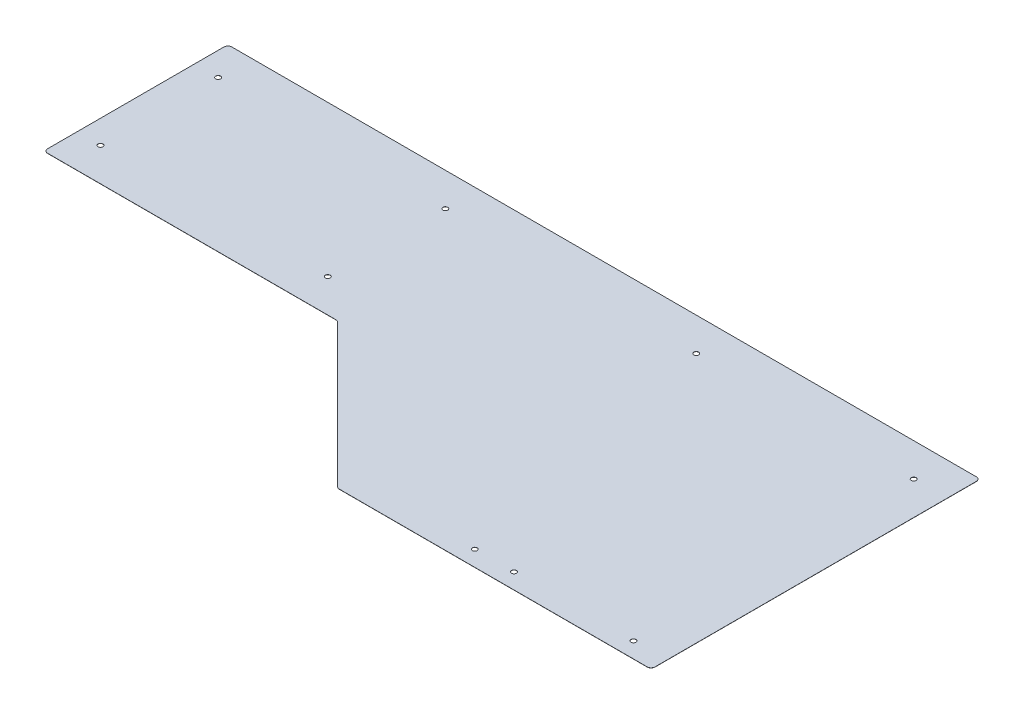
ISO-10303-21;
HEADER;
FILE_DESCRIPTION(('STEP AP214'),'2;1');
FILE_NAME('part.step','',(''),(''),'','','');
FILE_SCHEMA(('AUTOMOTIVE_DESIGN { 1 0 10303 214 1 1 1 1 }'));
ENDSEC;
DATA;
#1=APPLICATION_CONTEXT('core data for automotive mechanical design processes');
#2=APPLICATION_PROTOCOL_DEFINITION('international standard','automotive_design',2000,#1);
#3=PRODUCT_CONTEXT('',#1,'mechanical');
#4=PRODUCT('Part','Part','',(#3));
#5=PRODUCT_RELATED_PRODUCT_CATEGORY('part','',(#4));
#6=PRODUCT_DEFINITION_FORMATION('','',#4);
#7=PRODUCT_DEFINITION_CONTEXT('part definition',#1,'design');
#8=PRODUCT_DEFINITION('design','',#6,#7);
#9=PRODUCT_DEFINITION_SHAPE('','',#8);
#10=(LENGTH_UNIT() NAMED_UNIT(*) SI_UNIT(.MILLI.,.METRE.));
#11=(NAMED_UNIT(*) PLANE_ANGLE_UNIT() SI_UNIT($,.RADIAN.));
#12=(NAMED_UNIT(*) SI_UNIT($,.STERADIAN.) SOLID_ANGLE_UNIT());
#13=UNCERTAINTY_MEASURE_WITH_UNIT(LENGTH_MEASURE(1.E-05),#10,'distance_accuracy_value','');
#14=(GEOMETRIC_REPRESENTATION_CONTEXT(3) GLOBAL_UNCERTAINTY_ASSIGNED_CONTEXT((#13)) GLOBAL_UNIT_ASSIGNED_CONTEXT((#10,
#11,#12)) REPRESENTATION_CONTEXT('',''));
#15=CARTESIAN_POINT('',(0.,0.,0.));
#16=DIRECTION('',(0.,0.,1.));
#17=DIRECTION('',(1.,0.,0.));
#18=AXIS2_PLACEMENT_3D('',#15,#16,#17);
#19=CARTESIAN_POINT('',(-505.369743878931,1.5875,-6.35));
#20=DIRECTION('',(0.,-1.,0.));
#21=DIRECTION('',(0.,0.,-1.));
#22=AXIS2_PLACEMENT_3D('',#19,#20,#21);
#23=CYLINDRICAL_SURFACE('',#22,6.35000000000002);
#24=DIRECTION('',(0.,-1.,0.));
#25=VECTOR('',#24,1.);
#26=CARTESIAN_POINT('',(-505.369743878931,1.5875,0.));
#27=LINE('',#26,#25);
#28=CARTESIAN_POINT('',(-505.369743878931,0.254,0.));
#29=VERTEX_POINT('',#28);
#30=CARTESIAN_POINT('',(-505.369743878931,0.,0.));
#31=VERTEX_POINT('',#30);
#32=EDGE_CURVE('E272',#29,#31,#27,.T.);
#33=ORIENTED_EDGE('',*,*,#32,.F.);
#34=CARTESIAN_POINT('',(-505.369743878931,0.254,-6.35));
#35=DIRECTION('',(0.,-1.,0.));
#36=DIRECTION('',(0.,0.,-1.));
#37=AXIS2_PLACEMENT_3D('',#34,#35,#36);
#38=CIRCLE('',#37,6.35000000000002);
#39=CARTESIAN_POINT('',(-509.859871939465,0.254,-1.85987193946541));
#40=VERTEX_POINT('',#39);
#41=EDGE_CURVE('E189',#29,#40,#38,.T.);
#42=ORIENTED_EDGE('',*,*,#41,.T.);
#43=DIRECTION('',(0.,-1.,0.));
#44=VECTOR('',#43,1.);
#45=CARTESIAN_POINT('',(-509.859871939465,1.5875,-1.8598719394654));
#46=LINE('',#45,#44);
#47=CARTESIAN_POINT('',(-509.859871939465,0.,-1.8598719394654));
#48=VERTEX_POINT('',#47);
#49=EDGE_CURVE('E266',#40,#48,#46,.T.);
#50=ORIENTED_EDGE('',*,*,#49,.T.);
#51=CARTESIAN_POINT('',(-505.369743878931,0.,-6.35));
#52=DIRECTION('',(0.,1.,0.));
#53=DIRECTION('',(0.,0.,-1.));
#54=AXIS2_PLACEMENT_3D('',#51,#52,#53);
#55=CIRCLE('',#54,6.35000000000002);
#56=EDGE_CURVE('E246',#48,#31,#55,.T.);
#57=ORIENTED_EDGE('',*,*,#56,.T.);
#58=EDGE_LOOP('',(#33,#42,#50,#57));
#59=FACE_BOUND('',#58,.T.);
#60=ADVANCED_FACE('F35',(#59),#23,.T.);
#61=CARTESIAN_POINT('',(-505.369743878931,1.5875,0.));
#62=DIRECTION('',(0.,0.,-1.));
#63=DIRECTION('',(-1.,0.,0.));
#64=AXIS2_PLACEMENT_3D('',#61,#62,#63);
#65=PLANE('',#64);
#66=DIRECTION('',(0.,-1.,0.));
#67=VECTOR('',#66,1.);
#68=CARTESIAN_POINT('',(-6.35000000000002,1.5875,0.));
#69=LINE('',#68,#67);
#70=CARTESIAN_POINT('',(-6.35000000000002,0.,0.));
#71=VERTEX_POINT('',#70);
#72=CARTESIAN_POINT('',(-6.35,0.254,0.));
#73=VERTEX_POINT('',#72);
#74=EDGE_CURVE('E43',#71,#73,#69,.F.);
#75=ORIENTED_EDGE('',*,*,#74,.T.);
#76=DIRECTION('',(1.,0.,0.));
#77=VECTOR('',#76,1.);
#78=CARTESIAN_POINT('',(-1219.2,0.254,0.));
#79=LINE('',#78,#77);
#80=EDGE_CURVE('E132',#29,#73,#79,.T.);
#81=ORIENTED_EDGE('',*,*,#80,.F.);
#82=ORIENTED_EDGE('',*,*,#32,.T.);
#83=DIRECTION('',(1.,0.,0.));
#84=VECTOR('',#83,1.);
#85=CARTESIAN_POINT('',(-505.369743878931,0.,0.));
#86=LINE('',#85,#84);
#87=EDGE_CURVE('E170',#31,#71,#86,.T.);
#88=ORIENTED_EDGE('',*,*,#87,.T.);
#89=EDGE_LOOP('',(#75,#81,#82,#88));
#90=FACE_BOUND('',#89,.T.);
#91=ADVANCED_FACE('F168',(#90),#65,.F.);
#92=CARTESIAN_POINT('',(0.,1.5875,0.));
#93=DIRECTION('',(-1.,0.,0.));
#94=DIRECTION('',(0.,0.,1.));
#95=AXIS2_PLACEMENT_3D('',#92,#93,#94);
#96=PLANE('',#95);
#97=DIRECTION('',(0.,-1.,0.));
#98=VECTOR('',#97,1.);
#99=CARTESIAN_POINT('',(0.,1.5875,-527.05));
#100=LINE('',#99,#98);
#101=CARTESIAN_POINT('',(0.,0.,-527.05));
#102=VERTEX_POINT('',#101);
#103=CARTESIAN_POINT('',(0.,0.254,-527.05));
#104=VERTEX_POINT('',#103);
#105=EDGE_CURVE('E162',#102,#104,#100,.F.);
#106=ORIENTED_EDGE('',*,*,#105,.T.);
#107=DIRECTION('',(0.,0.,-1.));
#108=VECTOR('',#107,1.);
#109=CARTESIAN_POINT('',(0.,0.254,0.));
#110=LINE('',#109,#108);
#111=CARTESIAN_POINT('',(0.,0.254,-6.35));
#112=VERTEX_POINT('',#111);
#113=EDGE_CURVE('E133',#112,#104,#110,.T.);
#114=ORIENTED_EDGE('',*,*,#113,.F.);
#115=DIRECTION('',(0.,-1.,0.));
#116=VECTOR('',#115,1.);
#117=CARTESIAN_POINT('',(0.,1.5875,-6.35));
#118=LINE('',#117,#116);
#119=CARTESIAN_POINT('',(0.,0.,-6.35));
#120=VERTEX_POINT('',#119);
#121=EDGE_CURVE('E160',#112,#120,#118,.T.);
#122=ORIENTED_EDGE('',*,*,#121,.T.);
#123=DIRECTION('',(0.,0.,-1.));
#124=VECTOR('',#123,1.);
#125=CARTESIAN_POINT('',(0.,0.,0.));
#126=LINE('',#125,#124);
#127=EDGE_CURVE('E250',#120,#102,#126,.T.);
#128=ORIENTED_EDGE('',*,*,#127,.T.);
#129=EDGE_LOOP('',(#106,#114,#122,#128));
#130=FACE_BOUND('',#129,.T.);
#131=ADVANCED_FACE('F299',(#130),#96,.F.);
#132=CARTESIAN_POINT('',(-1219.2,1.5875,-533.4));
#133=DIRECTION('',(0.,0.,1.));
#134=DIRECTION('',(1.,0.,0.));
#135=AXIS2_PLACEMENT_3D('',#132,#133,#134);
#136=PLANE('',#135);
#137=DIRECTION('',(0.,-1.,0.));
#138=VECTOR('',#137,1.);
#139=CARTESIAN_POINT('',(-1212.85,1.5875,-533.4));
#140=LINE('',#139,#138);
#141=CARTESIAN_POINT('',(-1212.85,0.,-533.4));
#142=VERTEX_POINT('',#141);
#143=CARTESIAN_POINT('',(-1212.85,0.254,-533.4));
#144=VERTEX_POINT('',#143);
#145=EDGE_CURVE('E149',#142,#144,#140,.F.);
#146=ORIENTED_EDGE('',*,*,#145,.T.);
#147=DIRECTION('',(1.,0.,0.));
#148=VECTOR('',#147,1.);
#149=CARTESIAN_POINT('',(-1219.2,0.254,-533.4));
#150=LINE('',#149,#148);
#151=CARTESIAN_POINT('',(-6.35000000000008,0.254,-533.4));
#152=VERTEX_POINT('',#151);
#153=EDGE_CURVE('E49',#144,#152,#150,.T.);
#154=ORIENTED_EDGE('',*,*,#153,.T.);
#155=DIRECTION('',(0.,-1.,0.));
#156=VECTOR('',#155,1.);
#157=CARTESIAN_POINT('',(-6.35000000000008,1.5875,-533.4));
#158=LINE('',#157,#156);
#159=CARTESIAN_POINT('',(-6.35000000000052,0.,-533.4));
#160=VERTEX_POINT('',#159);
#161=EDGE_CURVE('E153',#152,#160,#158,.T.);
#162=ORIENTED_EDGE('',*,*,#161,.T.);
#163=DIRECTION('',(-1.,0.,0.));
#164=VECTOR('',#163,1.);
#165=CARTESIAN_POINT('',(-1219.2,0.,-533.4));
#166=LINE('',#165,#164);
#167=EDGE_CURVE('E253',#160,#142,#166,.T.);
#168=ORIENTED_EDGE('',*,*,#167,.T.);
#169=EDGE_LOOP('',(#146,#154,#162,#168));
#170=FACE_BOUND('',#169,.T.);
#171=ADVANCED_FACE('F322',(#170),#136,.F.);
#172=CARTESIAN_POINT('',(-1219.2,1.5875,-234.95));
#173=DIRECTION('',(1.,0.,0.));
#174=DIRECTION('',(0.,0.,-1.));
#175=AXIS2_PLACEMENT_3D('',#172,#173,#174);
#176=PLANE('',#175);
#177=DIRECTION('',(0.,-1.,0.));
#178=VECTOR('',#177,1.);
#179=CARTESIAN_POINT('',(-1219.2,1.5875,-241.3));
#180=LINE('',#179,#178);
#181=CARTESIAN_POINT('',(-1219.2,0.,-241.3));
#182=VERTEX_POINT('',#181);
#183=CARTESIAN_POINT('',(-1219.2,0.254,-241.3));
#184=VERTEX_POINT('',#183);
#185=EDGE_CURVE('E140',#182,#184,#180,.F.);
#186=ORIENTED_EDGE('',*,*,#185,.T.);
#187=DIRECTION('',(0.,0.,-1.));
#188=VECTOR('',#187,1.);
#189=CARTESIAN_POINT('',(-1219.2,0.254,0.));
#190=LINE('',#189,#188);
#191=CARTESIAN_POINT('',(-1219.2,0.254,-527.05));
#192=VERTEX_POINT('',#191);
#193=EDGE_CURVE('E123',#184,#192,#190,.T.);
#194=ORIENTED_EDGE('',*,*,#193,.T.);
#195=DIRECTION('',(0.,-1.,0.));
#196=VECTOR('',#195,1.);
#197=CARTESIAN_POINT('',(-1219.2,1.5875,-527.05));
#198=LINE('',#197,#196);
#199=CARTESIAN_POINT('',(-1219.2,0.,-527.05));
#200=VERTEX_POINT('',#199);
#201=EDGE_CURVE('E150',#192,#200,#198,.T.);
#202=ORIENTED_EDGE('',*,*,#201,.T.);
#203=DIRECTION('',(0.,0.,1.));
#204=VECTOR('',#203,1.);
#205=CARTESIAN_POINT('',(-1219.2,0.,-234.95));
#206=LINE('',#205,#204);
#207=EDGE_CURVE('E148',#200,#182,#206,.T.);
#208=ORIENTED_EDGE('',*,*,#207,.T.);
#209=EDGE_LOOP('',(#186,#194,#202,#208));
#210=FACE_BOUND('',#209,.T.);
#211=ADVANCED_FACE('F146',(#210),#176,.F.);
#212=CARTESIAN_POINT('',(-1219.2,1.5875,-234.95));
#213=DIRECTION('',(0.,0.,-1.));
#214=DIRECTION('',(-1.,0.,0.));
#215=AXIS2_PLACEMENT_3D('',#212,#213,#214);
#216=PLANE('',#215);
#217=DIRECTION('',(0.,-1.,0.));
#218=VECTOR('',#217,1.);
#219=CARTESIAN_POINT('',(-745.580256121068,1.5875,-234.95));
#220=LINE('',#219,#218);
#221=CARTESIAN_POINT('',(-745.580256121068,0.254,-234.95));
#222=VERTEX_POINT('',#221);
#223=CARTESIAN_POINT('',(-745.580256121068,0.,-234.95));
#224=VERTEX_POINT('',#223);
#225=EDGE_CURVE('E270',#222,#224,#220,.T.);
#226=ORIENTED_EDGE('',*,*,#225,.F.);
#227=DIRECTION('',(-1.,0.,0.));
#228=VECTOR('',#227,1.);
#229=CARTESIAN_POINT('',(-1219.2,0.254,-234.95));
#230=LINE('',#229,#228);
#231=CARTESIAN_POINT('',(-1212.85,0.254,-234.95));
#232=VERTEX_POINT('',#231);
#233=EDGE_CURVE('E142',#222,#232,#230,.T.);
#234=ORIENTED_EDGE('',*,*,#233,.T.);
#235=DIRECTION('',(0.,-1.,0.));
#236=VECTOR('',#235,1.);
#237=CARTESIAN_POINT('',(-1212.85,1.5875,-234.95));
#238=LINE('',#237,#236);
#239=CARTESIAN_POINT('',(-1212.85,0.,-234.95));
#240=VERTEX_POINT('',#239);
#241=EDGE_CURVE('E141',#232,#240,#238,.T.);
#242=ORIENTED_EDGE('',*,*,#241,.T.);
#243=DIRECTION('',(1.,0.,0.));
#244=VECTOR('',#243,1.);
#245=CARTESIAN_POINT('',(-1219.2,0.,-234.95));
#246=LINE('',#245,#244);
#247=EDGE_CURVE('E257',#240,#224,#246,.T.);
#248=ORIENTED_EDGE('',*,*,#247,.T.);
#249=EDGE_LOOP('',(#226,#234,#242,#248));
#250=FACE_BOUND('',#249,.T.);
#251=ADVANCED_FACE('F285',(#250),#216,.F.);
#252=CARTESIAN_POINT('',(-745.580256121068,1.5875,-228.6));
#253=DIRECTION('',(0.,-1.,0.));
#254=DIRECTION('',(0.,0.,-1.));
#255=AXIS2_PLACEMENT_3D('',#252,#253,#254);
#256=CYLINDRICAL_SURFACE('',#255,6.35);
#257=DIRECTION('',(0.,-1.,0.));
#258=VECTOR('',#257,1.);
#259=CARTESIAN_POINT('',(-741.090128060534,1.5875,-233.090128060535));
#260=LINE('',#259,#258);
#261=CARTESIAN_POINT('',(-741.090128060534,0.254,-233.090128060535));
#262=VERTEX_POINT('',#261);
#263=CARTESIAN_POINT('',(-741.090128060534,0.,-233.090128060535));
#264=VERTEX_POINT('',#263);
#265=EDGE_CURVE('E268',#262,#264,#260,.T.);
#266=ORIENTED_EDGE('',*,*,#265,.F.);
#267=CARTESIAN_POINT('',(-745.580256121068,0.254,-228.6));
#268=DIRECTION('',(0.,-1.,0.));
#269=DIRECTION('',(0.,0.,-1.));
#270=AXIS2_PLACEMENT_3D('',#267,#268,#269);
#271=CIRCLE('',#270,6.35);
#272=EDGE_CURVE('E183',#262,#222,#271,.F.);
#273=ORIENTED_EDGE('',*,*,#272,.T.);
#274=ORIENTED_EDGE('',*,*,#225,.T.);
#275=CARTESIAN_POINT('',(-745.580256121068,0.,-228.6));
#276=DIRECTION('',(0.,-1.,0.));
#277=DIRECTION('',(0.,0.,1.));
#278=AXIS2_PLACEMENT_3D('',#275,#276,#277);
#279=CIRCLE('',#278,6.35);
#280=EDGE_CURVE('E260',#224,#264,#279,.T.);
#281=ORIENTED_EDGE('',*,*,#280,.T.);
#282=EDGE_LOOP('',(#266,#273,#274,#281));
#283=FACE_BOUND('',#282,.T.);
#284=ADVANCED_FACE('F288',(#283),#256,.F.);
#285=CARTESIAN_POINT('',(-741.090128060534,1.5875,-233.090128060535));
#286=DIRECTION('',(0.707106781186549,0.,-0.707106781186546));
#287=DIRECTION('',(-0.707106781186546,0.,-0.707106781186549));
#288=AXIS2_PLACEMENT_3D('',#285,#286,#287);
#289=PLANE('',#288);
#290=ORIENTED_EDGE('',*,*,#49,.F.);
#291=DIRECTION('',(-0.707106781186546,0.,-0.707106781186549));
#292=VECTOR('',#291,1.);
#293=CARTESIAN_POINT('',(-741.090128060534,0.254,-233.090128060535));
#294=LINE('',#293,#292);
#295=EDGE_CURVE('E186',#40,#262,#294,.T.);
#296=ORIENTED_EDGE('',*,*,#295,.T.);
#297=ORIENTED_EDGE('',*,*,#265,.T.);
#298=DIRECTION('',(0.707106781186546,0.,0.707106781186549));
#299=VECTOR('',#298,1.);
#300=CARTESIAN_POINT('',(-741.090128060534,0.,-233.090128060535));
#301=LINE('',#300,#299);
#302=EDGE_CURVE('E263',#264,#48,#301,.T.);
#303=ORIENTED_EDGE('',*,*,#302,.T.);
#304=EDGE_LOOP('',(#290,#296,#297,#303));
#305=FACE_BOUND('',#304,.T.);
#306=ADVANCED_FACE('F291',(#305),#289,.F.);
#307=CARTESIAN_POINT('',(-505.369743878931,0.,-6.35));
#308=DIRECTION('',(0.,-1.,0.));
#309=DIRECTION('',(0.,0.,-1.));
#310=AXIS2_PLACEMENT_3D('',#307,#308,#309);
#311=PLANE('',#310);
#312=CARTESIAN_POINT('',(-1181.1,0.,-479.425));
#313=DIRECTION('',(0.,1.,0.));
#314=DIRECTION('',(0.,0.,1.));
#315=AXIS2_PLACEMENT_3D('',#312,#313,#314);
#316=CIRCLE('',#315,3.96875000000008);
#317=CARTESIAN_POINT('',(-1181.1,0.,-475.45625));
#318=VERTEX_POINT('',#317);
#319=EDGE_CURVE('E219',#318,#318,#316,.T.);
#320=ORIENTED_EDGE('',*,*,#319,.T.);
#321=EDGE_LOOP('',(#320));
#322=FACE_BOUND('',#321,.T.);
#323=CARTESIAN_POINT('',(-1181.1,0.,-288.925));
#324=DIRECTION('',(0.,1.,0.));
#325=DIRECTION('',(0.,0.,1.));
#326=AXIS2_PLACEMENT_3D('',#323,#324,#325);
#327=CIRCLE('',#326,3.96875000000008);
#328=CARTESIAN_POINT('',(-1181.1,0.,-284.95625));
#329=VERTEX_POINT('',#328);
#330=EDGE_CURVE('E222',#329,#329,#327,.T.);
#331=ORIENTED_EDGE('',*,*,#330,.T.);
#332=EDGE_LOOP('',(#331));
#333=FACE_BOUND('',#332,.T.);
#334=CARTESIAN_POINT('',(-812.8,0.,-288.925));
#335=DIRECTION('',(0.,1.,0.));
#336=DIRECTION('',(0.,0.,1.));
#337=AXIS2_PLACEMENT_3D('',#334,#335,#336);
#338=CIRCLE('',#337,3.96874999999997);
#339=CARTESIAN_POINT('',(-812.8,0.,-284.95625));
#340=VERTEX_POINT('',#339);
#341=EDGE_CURVE('E225',#340,#340,#338,.T.);
#342=ORIENTED_EDGE('',*,*,#341,.T.);
#343=EDGE_LOOP('',(#342));
#344=FACE_BOUND('',#343,.T.);
#345=CARTESIAN_POINT('',(-812.8,0.,-479.425));
#346=DIRECTION('',(0.,1.,0.));
#347=DIRECTION('',(0.,0.,1.));
#348=AXIS2_PLACEMENT_3D('',#345,#346,#347);
#349=CIRCLE('',#348,3.96874999999997);
#350=CARTESIAN_POINT('',(-812.8,0.,-475.45625));
#351=VERTEX_POINT('',#350);
#352=EDGE_CURVE('E228',#351,#351,#349,.T.);
#353=ORIENTED_EDGE('',*,*,#352,.T.);
#354=EDGE_LOOP('',(#353));
#355=FACE_BOUND('',#354,.T.);
#356=CARTESIAN_POINT('',(-406.4,0.,-479.425));
#357=DIRECTION('',(0.,1.,0.));
#358=DIRECTION('',(0.,0.,1.));
#359=AXIS2_PLACEMENT_3D('',#356,#357,#358);
#360=CIRCLE('',#359,3.96875000000002);
#361=CARTESIAN_POINT('',(-406.4,0.,-475.45625));
#362=VERTEX_POINT('',#361);
#363=EDGE_CURVE('E231',#362,#362,#360,.T.);
#364=ORIENTED_EDGE('',*,*,#363,.T.);
#365=EDGE_LOOP('',(#364));
#366=FACE_BOUND('',#365,.T.);
#367=CARTESIAN_POINT('',(-53.975,0.,-479.425));
#368=DIRECTION('',(0.,1.,0.));
#369=DIRECTION('',(0.,0.,1.));
#370=AXIS2_PLACEMENT_3D('',#367,#368,#369);
#371=CIRCLE('',#370,3.96875);
#372=CARTESIAN_POINT('',(-53.975,0.,-475.45625));
#373=VERTEX_POINT('',#372);
#374=EDGE_CURVE('E234',#373,#373,#371,.T.);
#375=ORIENTED_EDGE('',*,*,#374,.T.);
#376=EDGE_LOOP('',(#375));
#377=FACE_BOUND('',#376,.T.);
#378=CARTESIAN_POINT('',(-53.975,0.,-25.4));
#379=DIRECTION('',(0.,1.,0.));
#380=DIRECTION('',(0.,0.,1.));
#381=AXIS2_PLACEMENT_3D('',#378,#379,#380);
#382=CIRCLE('',#381,3.96875);
#383=CARTESIAN_POINT('',(-53.975,0.,-21.43125));
#384=VERTEX_POINT('',#383);
#385=EDGE_CURVE('E237',#384,#384,#382,.T.);
#386=ORIENTED_EDGE('',*,*,#385,.T.);
#387=EDGE_LOOP('',(#386));
#388=FACE_BOUND('',#387,.T.);
#389=CARTESIAN_POINT('',(-247.65,0.,-25.4));
#390=DIRECTION('',(0.,1.,0.));
#391=DIRECTION('',(0.,0.,1.));
#392=AXIS2_PLACEMENT_3D('',#389,#390,#391);
#393=CIRCLE('',#392,3.96874999999999);
#394=CARTESIAN_POINT('',(-247.65,0.,-21.43125));
#395=VERTEX_POINT('',#394);
#396=EDGE_CURVE('E240',#395,#395,#393,.T.);
#397=ORIENTED_EDGE('',*,*,#396,.T.);
#398=EDGE_LOOP('',(#397));
#399=FACE_BOUND('',#398,.T.);
#400=CARTESIAN_POINT('',(-311.15,0.,-25.4));
#401=DIRECTION('',(0.,1.,0.));
#402=DIRECTION('',(0.,0.,1.));
#403=AXIS2_PLACEMENT_3D('',#400,#401,#402);
#404=CIRCLE('',#403,3.96875000000002);
#405=CARTESIAN_POINT('',(-311.15,0.,-21.43125));
#406=VERTEX_POINT('',#405);
#407=EDGE_CURVE('E243',#406,#406,#404,.T.);
#408=ORIENTED_EDGE('',*,*,#407,.T.);
#409=EDGE_LOOP('',(#408));
#410=FACE_BOUND('',#409,.T.);
#411=ORIENTED_EDGE('',*,*,#247,.F.);
#412=CARTESIAN_POINT('',(-1212.85,0.,-241.3));
#413=DIRECTION('',(0.,-1.,0.));
#414=DIRECTION('',(0.,0.,-1.));
#415=AXIS2_PLACEMENT_3D('',#412,#413,#414);
#416=CIRCLE('',#415,6.35);
#417=EDGE_CURVE('E155',#240,#182,#416,.T.);
#418=ORIENTED_EDGE('',*,*,#417,.T.);
#419=ORIENTED_EDGE('',*,*,#207,.F.);
#420=CARTESIAN_POINT('',(-1212.85,0.,-527.05));
#421=DIRECTION('',(0.,-1.,0.));
#422=DIRECTION('',(0.,0.,-1.));
#423=AXIS2_PLACEMENT_3D('',#420,#421,#422);
#424=CIRCLE('',#423,6.35);
#425=EDGE_CURVE('E275',#200,#142,#424,.T.);
#426=ORIENTED_EDGE('',*,*,#425,.T.);
#427=ORIENTED_EDGE('',*,*,#167,.F.);
#428=CARTESIAN_POINT('',(-6.35000000000008,0.,-527.05));
#429=DIRECTION('',(0.,-1.,0.));
#430=DIRECTION('',(0.,0.,-1.));
#431=AXIS2_PLACEMENT_3D('',#428,#429,#430);
#432=CIRCLE('',#431,6.35);
#433=EDGE_CURVE('E278',#160,#102,#432,.T.);
#434=ORIENTED_EDGE('',*,*,#433,.T.);
#435=ORIENTED_EDGE('',*,*,#127,.F.);
#436=CARTESIAN_POINT('',(-6.35,0.,-6.35));
#437=DIRECTION('',(0.,-1.,0.));
#438=DIRECTION('',(0.,0.,-1.));
#439=AXIS2_PLACEMENT_3D('',#436,#437,#438);
#440=CIRCLE('',#439,6.35);
#441=EDGE_CURVE('E57',#120,#71,#440,.T.);
#442=ORIENTED_EDGE('',*,*,#441,.T.);
#443=ORIENTED_EDGE('',*,*,#87,.F.);
#444=ORIENTED_EDGE('',*,*,#56,.F.);
#445=ORIENTED_EDGE('',*,*,#302,.F.);
#446=ORIENTED_EDGE('',*,*,#280,.F.);
#447=EDGE_LOOP('',(#411,#418,#419,#426,#427,#434,#435,#442,#443,#444,#445,#446));
#448=FACE_BOUND('',#447,.T.);
#449=ADVANCED_FACE('F280',(#322,#333,#344,#355,#366,#377,#388,#399,#410,#448),#311,.T.);
#450=CARTESIAN_POINT('',(-311.15,1.5875,-25.4));
#451=DIRECTION('',(0.,1.,0.));
#452=DIRECTION('',(0.,0.,1.));
#453=AXIS2_PLACEMENT_3D('',#450,#451,#452);
#454=CYLINDRICAL_SURFACE('',#453,3.96875000000002);
#455=CARTESIAN_POINT('',(-311.15,0.254,-25.4));
#456=DIRECTION('',(0.,-1.,0.));
#457=DIRECTION('',(0.,0.,-1.));
#458=AXIS2_PLACEMENT_3D('',#455,#456,#457);
#459=CIRCLE('',#458,3.96875000000002);
#460=CARTESIAN_POINT('',(-311.15,0.254,-29.36875));
#461=VERTEX_POINT('',#460);
#462=EDGE_CURVE('E216',#461,#461,#459,.F.);
#463=ORIENTED_EDGE('',*,*,#462,.T.);
#464=EDGE_LOOP('',(#463));
#465=FACE_BOUND('',#464,.T.);
#466=ORIENTED_EDGE('',*,*,#407,.F.);
#467=EDGE_LOOP('',(#466));
#468=FACE_BOUND('',#467,.T.);
#469=ADVANCED_FACE('F346',(#465,#468),#454,.F.);
#470=CARTESIAN_POINT('',(-247.65,1.5875,-25.4));
#471=DIRECTION('',(0.,1.,0.));
#472=DIRECTION('',(0.,0.,1.));
#473=AXIS2_PLACEMENT_3D('',#470,#471,#472);
#474=CYLINDRICAL_SURFACE('',#473,3.96874999999999);
#475=CARTESIAN_POINT('',(-247.65,0.254,-25.4));
#476=DIRECTION('',(0.,-1.,0.));
#477=DIRECTION('',(0.,0.,-1.));
#478=AXIS2_PLACEMENT_3D('',#475,#476,#477);
#479=CIRCLE('',#478,3.96874999999999);
#480=CARTESIAN_POINT('',(-247.65,0.254,-29.36875));
#481=VERTEX_POINT('',#480);
#482=EDGE_CURVE('E213',#481,#481,#479,.F.);
#483=ORIENTED_EDGE('',*,*,#482,.T.);
#484=EDGE_LOOP('',(#483));
#485=FACE_BOUND('',#484,.T.);
#486=ORIENTED_EDGE('',*,*,#396,.F.);
#487=EDGE_LOOP('',(#486));
#488=FACE_BOUND('',#487,.T.);
#489=ADVANCED_FACE('F350',(#485,#488),#474,.F.);
#490=CARTESIAN_POINT('',(-53.975,1.5875,-25.4));
#491=DIRECTION('',(0.,1.,0.));
#492=DIRECTION('',(0.,0.,1.));
#493=AXIS2_PLACEMENT_3D('',#490,#491,#492);
#494=CYLINDRICAL_SURFACE('',#493,3.96875);
#495=CARTESIAN_POINT('',(-53.975,0.254,-25.4));
#496=DIRECTION('',(0.,-1.,0.));
#497=DIRECTION('',(0.,0.,-1.));
#498=AXIS2_PLACEMENT_3D('',#495,#496,#497);
#499=CIRCLE('',#498,3.96875);
#500=CARTESIAN_POINT('',(-53.975,0.254,-29.36875));
#501=VERTEX_POINT('',#500);
#502=EDGE_CURVE('E210',#501,#501,#499,.F.);
#503=ORIENTED_EDGE('',*,*,#502,.T.);
#504=EDGE_LOOP('',(#503));
#505=FACE_BOUND('',#504,.T.);
#506=ORIENTED_EDGE('',*,*,#385,.F.);
#507=EDGE_LOOP('',(#506));
#508=FACE_BOUND('',#507,.T.);
#509=ADVANCED_FACE('F354',(#505,#508),#494,.F.);
#510=CARTESIAN_POINT('',(-53.975,1.5875,-479.425));
#511=DIRECTION('',(0.,1.,0.));
#512=DIRECTION('',(0.,0.,1.));
#513=AXIS2_PLACEMENT_3D('',#510,#511,#512);
#514=CYLINDRICAL_SURFACE('',#513,3.96875);
#515=CARTESIAN_POINT('',(-53.975,0.254,-479.425));
#516=DIRECTION('',(0.,-1.,0.));
#517=DIRECTION('',(0.,0.,-1.));
#518=AXIS2_PLACEMENT_3D('',#515,#516,#517);
#519=CIRCLE('',#518,3.96875);
#520=CARTESIAN_POINT('',(-53.975,0.254,-483.39375));
#521=VERTEX_POINT('',#520);
#522=EDGE_CURVE('E207',#521,#521,#519,.F.);
#523=ORIENTED_EDGE('',*,*,#522,.T.);
#524=EDGE_LOOP('',(#523));
#525=FACE_BOUND('',#524,.T.);
#526=ORIENTED_EDGE('',*,*,#374,.F.);
#527=EDGE_LOOP('',(#526));
#528=FACE_BOUND('',#527,.T.);
#529=ADVANCED_FACE('F358',(#525,#528),#514,.F.);
#530=CARTESIAN_POINT('',(-406.4,1.5875,-479.425));
#531=DIRECTION('',(0.,1.,0.));
#532=DIRECTION('',(0.,0.,1.));
#533=AXIS2_PLACEMENT_3D('',#530,#531,#532);
#534=CYLINDRICAL_SURFACE('',#533,3.96875000000002);
#535=CARTESIAN_POINT('',(-406.4,0.254,-479.425));
#536=DIRECTION('',(0.,-1.,0.));
#537=DIRECTION('',(0.,0.,-1.));
#538=AXIS2_PLACEMENT_3D('',#535,#536,#537);
#539=CIRCLE('',#538,3.96875000000002);
#540=CARTESIAN_POINT('',(-406.4,0.254,-483.39375));
#541=VERTEX_POINT('',#540);
#542=EDGE_CURVE('E204',#541,#541,#539,.F.);
#543=ORIENTED_EDGE('',*,*,#542,.T.);
#544=EDGE_LOOP('',(#543));
#545=FACE_BOUND('',#544,.T.);
#546=ORIENTED_EDGE('',*,*,#363,.F.);
#547=EDGE_LOOP('',(#546));
#548=FACE_BOUND('',#547,.T.);
#549=ADVANCED_FACE('F362',(#545,#548),#534,.F.);
#550=CARTESIAN_POINT('',(-812.8,1.5875,-479.425));
#551=DIRECTION('',(0.,1.,0.));
#552=DIRECTION('',(0.,0.,1.));
#553=AXIS2_PLACEMENT_3D('',#550,#551,#552);
#554=CYLINDRICAL_SURFACE('',#553,3.96874999999997);
#555=CARTESIAN_POINT('',(-812.8,0.254,-479.425));
#556=DIRECTION('',(0.,-1.,0.));
#557=DIRECTION('',(0.,0.,-1.));
#558=AXIS2_PLACEMENT_3D('',#555,#556,#557);
#559=CIRCLE('',#558,3.96874999999997);
#560=CARTESIAN_POINT('',(-812.8,0.254,-483.39375));
#561=VERTEX_POINT('',#560);
#562=EDGE_CURVE('E201',#561,#561,#559,.F.);
#563=ORIENTED_EDGE('',*,*,#562,.T.);
#564=EDGE_LOOP('',(#563));
#565=FACE_BOUND('',#564,.T.);
#566=ORIENTED_EDGE('',*,*,#352,.F.);
#567=EDGE_LOOP('',(#566));
#568=FACE_BOUND('',#567,.T.);
#569=ADVANCED_FACE('F366',(#565,#568),#554,.F.);
#570=CARTESIAN_POINT('',(-812.8,1.5875,-288.925));
#571=DIRECTION('',(0.,1.,0.));
#572=DIRECTION('',(0.,0.,1.));
#573=AXIS2_PLACEMENT_3D('',#570,#571,#572);
#574=CYLINDRICAL_SURFACE('',#573,3.96874999999997);
#575=CARTESIAN_POINT('',(-812.8,0.254,-288.925));
#576=DIRECTION('',(0.,-1.,0.));
#577=DIRECTION('',(0.,0.,-1.));
#578=AXIS2_PLACEMENT_3D('',#575,#576,#577);
#579=CIRCLE('',#578,3.96874999999997);
#580=CARTESIAN_POINT('',(-812.8,0.254,-292.89375));
#581=VERTEX_POINT('',#580);
#582=EDGE_CURVE('E198',#581,#581,#579,.F.);
#583=ORIENTED_EDGE('',*,*,#582,.T.);
#584=EDGE_LOOP('',(#583));
#585=FACE_BOUND('',#584,.T.);
#586=ORIENTED_EDGE('',*,*,#341,.F.);
#587=EDGE_LOOP('',(#586));
#588=FACE_BOUND('',#587,.T.);
#589=ADVANCED_FACE('F370',(#585,#588),#574,.F.);
#590=CARTESIAN_POINT('',(-1181.1,1.5875,-288.925));
#591=DIRECTION('',(0.,1.,0.));
#592=DIRECTION('',(0.,0.,1.));
#593=AXIS2_PLACEMENT_3D('',#590,#591,#592);
#594=CYLINDRICAL_SURFACE('',#593,3.96875000000008);
#595=CARTESIAN_POINT('',(-1181.1,0.254,-288.925));
#596=DIRECTION('',(0.,-1.,0.));
#597=DIRECTION('',(0.,0.,-1.));
#598=AXIS2_PLACEMENT_3D('',#595,#596,#597);
#599=CIRCLE('',#598,3.96875000000008);
#600=CARTESIAN_POINT('',(-1181.1,0.254,-292.89375));
#601=VERTEX_POINT('',#600);
#602=EDGE_CURVE('E195',#601,#601,#599,.F.);
#603=ORIENTED_EDGE('',*,*,#602,.T.);
#604=EDGE_LOOP('',(#603));
#605=FACE_BOUND('',#604,.T.);
#606=ORIENTED_EDGE('',*,*,#330,.F.);
#607=EDGE_LOOP('',(#606));
#608=FACE_BOUND('',#607,.T.);
#609=ADVANCED_FACE('F374',(#605,#608),#594,.F.);
#610=CARTESIAN_POINT('',(-1181.1,1.5875,-479.425));
#611=DIRECTION('',(0.,1.,0.));
#612=DIRECTION('',(0.,0.,1.));
#613=AXIS2_PLACEMENT_3D('',#610,#611,#612);
#614=CYLINDRICAL_SURFACE('',#613,3.96875000000008);
#615=CARTESIAN_POINT('',(-1181.1,0.254,-479.425));
#616=DIRECTION('',(0.,-1.,0.));
#617=DIRECTION('',(0.,0.,-1.));
#618=AXIS2_PLACEMENT_3D('',#615,#616,#617);
#619=CIRCLE('',#618,3.96875000000008);
#620=CARTESIAN_POINT('',(-1181.1,0.254,-483.39375));
#621=VERTEX_POINT('',#620);
#622=EDGE_CURVE('E192',#621,#621,#619,.F.);
#623=ORIENTED_EDGE('',*,*,#622,.T.);
#624=EDGE_LOOP('',(#623));
#625=FACE_BOUND('',#624,.T.);
#626=ORIENTED_EDGE('',*,*,#319,.F.);
#627=EDGE_LOOP('',(#626));
#628=FACE_BOUND('',#627,.T.);
#629=ADVANCED_FACE('F306',(#625,#628),#614,.F.);
#630=CARTESIAN_POINT('',(-1212.85,1.5875,-241.3));
#631=DIRECTION('',(0.,-1.,0.));
#632=DIRECTION('',(0.,0.,-1.));
#633=AXIS2_PLACEMENT_3D('',#630,#631,#632);
#634=CYLINDRICAL_SURFACE('',#633,6.35);
#635=CARTESIAN_POINT('',(-1212.85,0.254,-241.3));
#636=DIRECTION('',(0.,-1.,0.));
#637=DIRECTION('',(0.,0.,-1.));
#638=AXIS2_PLACEMENT_3D('',#635,#636,#637);
#639=CIRCLE('',#638,6.35);
#640=EDGE_CURVE('E127',#184,#232,#639,.F.);
#641=ORIENTED_EDGE('',*,*,#640,.F.);
#642=ORIENTED_EDGE('',*,*,#185,.F.);
#643=ORIENTED_EDGE('',*,*,#417,.F.);
#644=ORIENTED_EDGE('',*,*,#241,.F.);
#645=EDGE_LOOP('',(#641,#642,#643,#644));
#646=FACE_BOUND('',#645,.T.);
#647=ADVANCED_FACE('F138',(#646),#634,.T.);
#648=CARTESIAN_POINT('',(-6.35000000000008,1.5875,-527.05));
#649=DIRECTION('',(0.,-1.,0.));
#650=DIRECTION('',(0.,0.,-1.));
#651=AXIS2_PLACEMENT_3D('',#648,#649,#650);
#652=CYLINDRICAL_SURFACE('',#651,6.35);
#653=CARTESIAN_POINT('',(-6.35000000000008,0.254,-527.05));
#654=DIRECTION('',(0.,-1.,0.));
#655=DIRECTION('',(0.,0.,-1.));
#656=AXIS2_PLACEMENT_3D('',#653,#654,#655);
#657=CIRCLE('',#656,6.35);
#658=EDGE_CURVE('E143',#104,#152,#657,.F.);
#659=ORIENTED_EDGE('',*,*,#658,.F.);
#660=ORIENTED_EDGE('',*,*,#105,.F.);
#661=ORIENTED_EDGE('',*,*,#433,.F.);
#662=ORIENTED_EDGE('',*,*,#161,.F.);
#663=EDGE_LOOP('',(#659,#660,#661,#662));
#664=FACE_BOUND('',#663,.T.);
#665=ADVANCED_FACE('F305',(#664),#652,.T.);
#666=CARTESIAN_POINT('',(-6.35,1.5875,-6.35));
#667=DIRECTION('',(0.,-1.,0.));
#668=DIRECTION('',(0.,0.,-1.));
#669=AXIS2_PLACEMENT_3D('',#666,#667,#668);
#670=CYLINDRICAL_SURFACE('',#669,6.35);
#671=CARTESIAN_POINT('',(-6.35,0.254,-6.35));
#672=DIRECTION('',(0.,-1.,0.));
#673=DIRECTION('',(0.,0.,-1.));
#674=AXIS2_PLACEMENT_3D('',#671,#672,#673);
#675=CIRCLE('',#674,6.35);
#676=EDGE_CURVE('E175',#73,#112,#675,.F.);
#677=ORIENTED_EDGE('',*,*,#676,.F.);
#678=ORIENTED_EDGE('',*,*,#74,.F.);
#679=ORIENTED_EDGE('',*,*,#441,.F.);
#680=ORIENTED_EDGE('',*,*,#121,.F.);
#681=EDGE_LOOP('',(#677,#678,#679,#680));
#682=FACE_BOUND('',#681,.T.);
#683=ADVANCED_FACE('F173',(#682),#670,.T.);
#684=CARTESIAN_POINT('',(-1212.85,1.5875,-527.05));
#685=DIRECTION('',(0.,-1.,0.));
#686=DIRECTION('',(0.,0.,-1.));
#687=AXIS2_PLACEMENT_3D('',#684,#685,#686);
#688=CYLINDRICAL_SURFACE('',#687,6.35);
#689=CARTESIAN_POINT('',(-1212.85,0.254,-527.05));
#690=DIRECTION('',(0.,-1.,0.));
#691=DIRECTION('',(0.,0.,-1.));
#692=AXIS2_PLACEMENT_3D('',#689,#690,#691);
#693=CIRCLE('',#692,6.35);
#694=EDGE_CURVE('E11',#144,#192,#693,.F.);
#695=ORIENTED_EDGE('',*,*,#694,.F.);
#696=ORIENTED_EDGE('',*,*,#145,.F.);
#697=ORIENTED_EDGE('',*,*,#425,.F.);
#698=ORIENTED_EDGE('',*,*,#201,.F.);
#699=EDGE_LOOP('',(#695,#696,#697,#698));
#700=FACE_BOUND('',#699,.T.);
#701=ADVANCED_FACE('F37',(#700),#688,.T.);
#702=CARTESIAN_POINT('',(-1219.2,0.254,0.));
#703=DIRECTION('',(0.,-1.,0.));
#704=DIRECTION('',(0.,0.,-1.));
#705=AXIS2_PLACEMENT_3D('',#702,#703,#704);
#706=PLANE('',#705);
#707=ORIENTED_EDGE('',*,*,#482,.F.);
#708=EDGE_LOOP('',(#707));
#709=FACE_BOUND('',#708,.T.);
#710=ORIENTED_EDGE('',*,*,#522,.F.);
#711=EDGE_LOOP('',(#710));
#712=FACE_BOUND('',#711,.T.);
#713=ORIENTED_EDGE('',*,*,#562,.F.);
#714=EDGE_LOOP('',(#713));
#715=FACE_BOUND('',#714,.T.);
#716=ORIENTED_EDGE('',*,*,#602,.F.);
#717=EDGE_LOOP('',(#716));
#718=FACE_BOUND('',#717,.T.);
#719=ORIENTED_EDGE('',*,*,#80,.T.);
#720=ORIENTED_EDGE('',*,*,#676,.T.);
#721=ORIENTED_EDGE('',*,*,#113,.T.);
#722=ORIENTED_EDGE('',*,*,#658,.T.);
#723=ORIENTED_EDGE('',*,*,#153,.F.);
#724=ORIENTED_EDGE('',*,*,#694,.T.);
#725=ORIENTED_EDGE('',*,*,#193,.F.);
#726=ORIENTED_EDGE('',*,*,#640,.T.);
#727=ORIENTED_EDGE('',*,*,#233,.F.);
#728=ORIENTED_EDGE('',*,*,#272,.F.);
#729=ORIENTED_EDGE('',*,*,#295,.F.);
#730=ORIENTED_EDGE('',*,*,#41,.F.);
#731=EDGE_LOOP('',(#719,#720,#721,#722,#723,#724,#725,#726,#727,#728,#729,#730));
#732=FACE_BOUND('',#731,.T.);
#733=ORIENTED_EDGE('',*,*,#622,.F.);
#734=EDGE_LOOP('',(#733));
#735=FACE_BOUND('',#734,.T.);
#736=ORIENTED_EDGE('',*,*,#582,.F.);
#737=EDGE_LOOP('',(#736));
#738=FACE_BOUND('',#737,.T.);
#739=ORIENTED_EDGE('',*,*,#542,.F.);
#740=EDGE_LOOP('',(#739));
#741=FACE_BOUND('',#740,.T.);
#742=ORIENTED_EDGE('',*,*,#502,.F.);
#743=EDGE_LOOP('',(#742));
#744=FACE_BOUND('',#743,.T.);
#745=ORIENTED_EDGE('',*,*,#462,.F.);
#746=EDGE_LOOP('',(#745));
#747=FACE_BOUND('',#746,.T.);
#748=ADVANCED_FACE('F125',(#709,#712,#715,#718,#732,#735,#738,#741,#744,#747),#706,.F.);
#749=CLOSED_SHELL('',(#60,#91,#131,#171,#211,#251,#284,#306,#449,#469,#489,#509,#529,#549,#569,
#589,#609,#629,#647,#665,#683,#701,#748));
#750=MANIFOLD_SOLID_BREP('B2',#749);
#751=ADVANCED_BREP_SHAPE_REPRESENTATION('',(#18,#750),#14);
#752=SHAPE_DEFINITION_REPRESENTATION(#9,#751);
ENDSEC;
END-ISO-10303-21;
